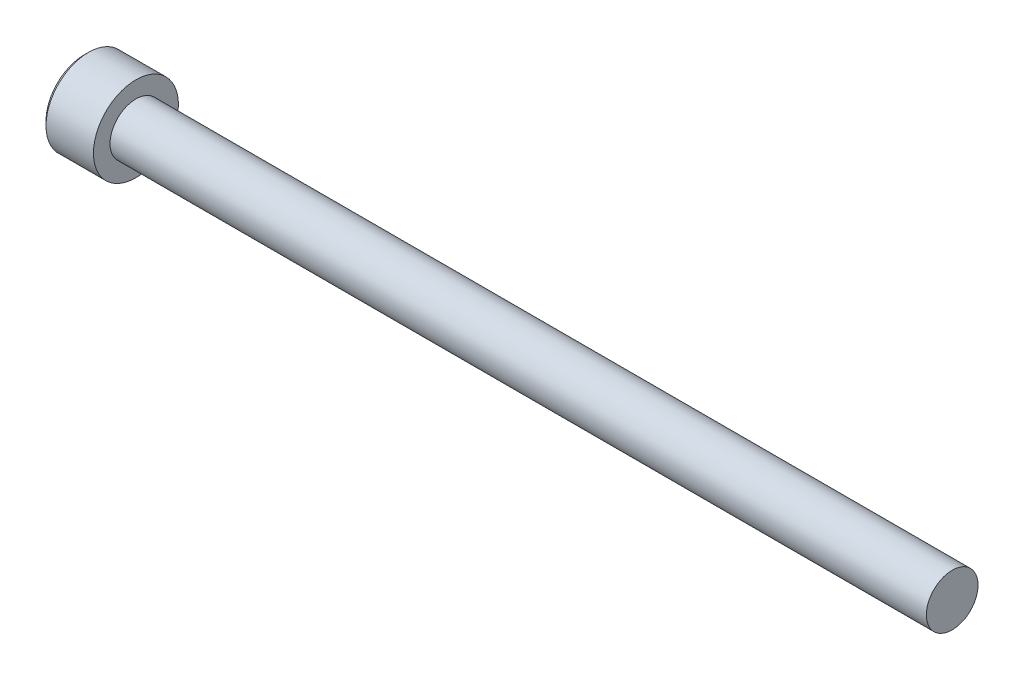
ISO-10303-21;
HEADER;
FILE_DESCRIPTION(('STEP AP214'),'2;1');
FILE_NAME('part.step','',(''),(''),'','','');
FILE_SCHEMA(('AUTOMOTIVE_DESIGN { 1 0 10303 214 1 1 1 1 }'));
ENDSEC;
DATA;
#1=APPLICATION_CONTEXT('core data for automotive mechanical design processes');
#2=APPLICATION_PROTOCOL_DEFINITION('international standard','automotive_design',2000,#1);
#3=PRODUCT_CONTEXT('',#1,'mechanical');
#4=PRODUCT('Part','Part','',(#3));
#5=PRODUCT_RELATED_PRODUCT_CATEGORY('part','',(#4));
#6=PRODUCT_DEFINITION_FORMATION('','',#4);
#7=PRODUCT_DEFINITION_CONTEXT('part definition',#1,'design');
#8=PRODUCT_DEFINITION('design','',#6,#7);
#9=PRODUCT_DEFINITION_SHAPE('','',#8);
#10=(LENGTH_UNIT() NAMED_UNIT(*) SI_UNIT(.MILLI.,.METRE.));
#11=(NAMED_UNIT(*) PLANE_ANGLE_UNIT() SI_UNIT($,.RADIAN.));
#12=(NAMED_UNIT(*) SI_UNIT($,.STERADIAN.) SOLID_ANGLE_UNIT());
#13=UNCERTAINTY_MEASURE_WITH_UNIT(LENGTH_MEASURE(1.E-05),#10,'distance_accuracy_value','');
#14=(GEOMETRIC_REPRESENTATION_CONTEXT(3) GLOBAL_UNCERTAINTY_ASSIGNED_CONTEXT((#13)) GLOBAL_UNIT_ASSIGNED_CONTEXT((#10,
#11,#12)) REPRESENTATION_CONTEXT('',''));
#15=CARTESIAN_POINT('',(0.,0.,0.));
#16=DIRECTION('',(0.,0.,1.));
#17=DIRECTION('',(1.,0.,0.));
#18=AXIS2_PLACEMENT_3D('',#15,#16,#17);
#19=CARTESIAN_POINT('',(-2.28600000000007,-1.14567944042317,1.984375));
#20=DIRECTION('',(0.,0.,1.));
#21=DIRECTION('',(1.,0.,0.));
#22=AXIS2_PLACEMENT_3D('',#19,#20,#21);
#23=PLANE('',#22);
#24=CARTESIAN_POINT('',(-4.82599999995852,1.14567944044653,1.98437499999554));
#25=CARTESIAN_POINT('',(-4.78691618362732,1.06743880343266,1.9843749999984));
#26=CARTESIAN_POINT('',(-4.75011447684892,0.987898318960917,1.98437499999957));
#27=CARTESIAN_POINT('',(-4.68265620500518,0.825677042028778,1.98437500000043));
#28=CARTESIAN_POINT('',(-4.65204056061138,0.742979382529199,1.98437500000012));
#29=CARTESIAN_POINT('',(-4.5991739228306,0.575193959555969,1.98437499999988));
#30=CARTESIAN_POINT('',(-4.57689462080725,0.490115359117279,1.98437499999997));
#31=CARTESIAN_POINT('',(-4.54259467221837,0.318093091130193,1.98437500000003));
#32=CARTESIAN_POINT('',(-4.5305423022885,0.231156054976726,1.984375));
#33=CARTESIAN_POINT('',(-4.52249110263747,0.119918521511051,1.984375));
#34=CARTESIAN_POINT('',(-4.52118947557477,0.0959468443046798,1.984375));
#35=CARTESIAN_POINT('',(-4.51945182629813,0.0479845644411998,1.984375));
#36=CARTESIAN_POINT('',(-4.51901533386223,0.0239939791589393,1.984375));
#37=CARTESIAN_POINT('',(-4.51901809008399,-0.0602201717457363,1.984375));
#38=CARTESIAN_POINT('',(-4.52177452299902,-0.120461721905447,1.984375));
#39=CARTESIAN_POINT('',(-4.5326365512493,-0.240474970989197,1.984375));
#40=CARTESIAN_POINT('',(-4.54074587749718,-0.300246312758427,1.984375));
#41=CARTESIAN_POINT('',(-4.57259622946939,-0.478763752804282,1.984375));
#42=CARTESIAN_POINT('',(-4.60385422611702,-0.596208828937734,1.984375));
#43=CARTESIAN_POINT('',(-4.66780003592237,-0.785921487441256,1.984375));
#44=CARTESIAN_POINT('',(-4.69623457768558,-0.859734609866899,1.984375));
#45=CARTESIAN_POINT('',(-4.75786140400812,-1.00456595519282,1.984375));
#46=CARTESIAN_POINT('',(-4.79100779300359,-1.07560356657101,1.984375));
#47=CARTESIAN_POINT('',(-4.82599999995643,-1.14567944044724,1.984375));
#48=B_SPLINE_CURVE_WITH_KNOTS('',3,(#24,#25,#26,#27,#28,#29,#30,#31,#32,#33,#34,#35,#36,#37,#38,
#39,#40,#41,#42,#43,#44,#45,#46,#47),.UNSPECIFIED.,.F.,.F.,(4,2,2,2,2,2,2,2,2,2,2,4),(0.,
0.262559005207405,0.526801735838036,0.790138824405318,1.05265603861765,1.12466619182083,
1.19663719499031,1.3772702672652,1.55802937209382,1.92104085090328,2.15819130092264,
2.39317265078575),.UNSPECIFIED.);
#49=CARTESIAN_POINT('',(-4.82599999996829,1.14567944041753,1.98437500003084));
#50=VERTEX_POINT('',#49);
#51=CARTESIAN_POINT('',(-4.8259999999622,-1.14567944043207,1.98437500001542));
#52=VERTEX_POINT('',#51);
#53=EDGE_CURVE('E20',#50,#52,#48,.T.);
#54=ORIENTED_EDGE('',*,*,#53,.F.);
#55=DIRECTION('',(1.,0.,0.));
#56=VECTOR('',#55,1.);
#57=CARTESIAN_POINT('',(-2.28600000000007,1.14567944042316,1.984375));
#58=LINE('',#57,#56);
#59=CARTESIAN_POINT('',(-2.28600000000007,1.14567944042316,1.984375));
#60=VERTEX_POINT('',#59);
#61=EDGE_CURVE('E68',#50,#60,#58,.T.);
#62=ORIENTED_EDGE('',*,*,#61,.T.);
#63=DIRECTION('',(0.,1.,0.));
#64=VECTOR('',#63,1.);
#65=CARTESIAN_POINT('',(-2.28600000000007,0.,1.984375));
#66=LINE('',#65,#64);
#67=CARTESIAN_POINT('',(-2.28600000000007,-1.14567944042317,1.984375));
#68=VERTEX_POINT('',#67);
#69=EDGE_CURVE('E74',#68,#60,#66,.T.);
#70=ORIENTED_EDGE('',*,*,#69,.F.);
#71=DIRECTION('',(1.,0.,0.));
#72=VECTOR('',#71,1.);
#73=CARTESIAN_POINT('',(-2.28600000000007,-1.14567944042317,1.984375));
#74=LINE('',#73,#72);
#75=EDGE_CURVE('E71',#68,#52,#74,.F.);
#76=ORIENTED_EDGE('',*,*,#75,.T.);
#77=EDGE_LOOP('',(#54,#62,#70,#76));
#78=FACE_BOUND('',#77,.T.);
#79=ADVANCED_FACE('F16',(#78),#23,.F.);
#80=CARTESIAN_POINT('',(-2.28600000000007,0.,0.));
#81=DIRECTION('',(-1.,0.,0.));
#82=DIRECTION('',(0.,0.,1.));
#83=AXIS2_PLACEMENT_3D('',#80,#81,#82);
#84=PLANE('',#83);
#85=DIRECTION('',(0.,0.5,0.866025403784439));
#86=VECTOR('',#85,1.);
#87=CARTESIAN_POINT('',(-2.28600000000007,2.29135888084633,0.));
#88=LINE('',#87,#86);
#89=CARTESIAN_POINT('',(-2.28600000000007,2.29135888084633,0.));
#90=VERTEX_POINT('',#89);
#91=CARTESIAN_POINT('',(-2.28600000000007,1.14567944042316,-1.984375));
#92=VERTEX_POINT('',#91);
#93=EDGE_CURVE('E82',#90,#92,#88,.F.);
#94=ORIENTED_EDGE('',*,*,#93,.T.);
#95=DIRECTION('',(0.,1.,0.));
#96=VECTOR('',#95,1.);
#97=CARTESIAN_POINT('',(-2.28600000000007,1.14567944042316,-1.984375));
#98=LINE('',#97,#96);
#99=CARTESIAN_POINT('',(-2.28600000000007,-1.14567944042316,-1.984375));
#100=VERTEX_POINT('',#99);
#101=EDGE_CURVE('E242',#92,#100,#98,.F.);
#102=ORIENTED_EDGE('',*,*,#101,.T.);
#103=DIRECTION('',(0.,0.5,-0.866025403784439));
#104=VECTOR('',#103,1.);
#105=CARTESIAN_POINT('',(-2.28600000000007,-1.14567944042316,-1.984375));
#106=LINE('',#105,#104);
#107=CARTESIAN_POINT('',(-2.28600000000007,-2.29135888084633,0.));
#108=VERTEX_POINT('',#107);
#109=EDGE_CURVE('E227',#100,#108,#106,.F.);
#110=ORIENTED_EDGE('',*,*,#109,.T.);
#111=DIRECTION('',(0.,-0.5,-0.866025403784439));
#112=VECTOR('',#111,1.);
#113=CARTESIAN_POINT('',(-2.28600000000007,-2.29135888084633,0.));
#114=LINE('',#113,#112);
#115=EDGE_CURVE('E224',#108,#68,#114,.F.);
#116=ORIENTED_EDGE('',*,*,#115,.T.);
#117=ORIENTED_EDGE('',*,*,#69,.T.);
#118=DIRECTION('',(0.,-0.5,0.866025403784439));
#119=VECTOR('',#118,1.);
#120=CARTESIAN_POINT('',(-2.28600000000007,1.14567944042316,1.984375));
#121=LINE('',#120,#119);
#122=EDGE_CURVE('E81',#60,#90,#121,.F.);
#123=ORIENTED_EDGE('',*,*,#122,.T.);
#124=EDGE_LOOP('',(#94,#102,#110,#116,#117,#123));
#125=FACE_BOUND('',#124,.T.);
#126=ADVANCED_FACE('F160',(#125),#84,.T.);
#127=CARTESIAN_POINT('',(-2.28600000000007,-1.14567944042316,-1.984375));
#128=DIRECTION('',(0.,-0.866025403784439,-0.5));
#129=DIRECTION('',(0.,0.5,-0.866025403784439));
#130=AXIS2_PLACEMENT_3D('',#127,#128,#129);
#131=PLANE('',#130);
#132=CARTESIAN_POINT('',(-4.82599999995871,-1.14567944040756,-1.98437500001887));
#133=CARTESIAN_POINT('',(-4.78666022792997,-1.18505700230148,-1.91617106214563));
#134=CARTESIAN_POINT('',(-4.74963132844072,-1.22509295783734,-1.8468267530301));
#135=CARTESIAN_POINT('',(-4.68183299424977,-1.30673037975396,-1.70542659047317));
#136=CARTESIAN_POINT('',(-4.65110127019237,-1.34833960561553,-1.63335729721673));
#137=CARTESIAN_POINT('',(-4.59845762010516,-1.432242568594,-1.48803310243203));
#138=CARTESIAN_POINT('',(-4.57641341195893,-1.47451494967301,-1.41481519064643));
#139=CARTESIAN_POINT('',(-4.54245011067441,-1.55999007976842,-1.26676792253773));
#140=CARTESIAN_POINT('',(-4.53050567471972,-1.6031902195197,-1.19194308559438));
#141=CARTESIAN_POINT('',(-4.51972842752365,-1.67764765054852,-1.06297903205139));
#142=CARTESIAN_POINT('',(-4.51813352794834,-1.70880881707173,-1.00900630841009));
#143=CARTESIAN_POINT('',(-4.52082392138599,-1.77108016542046,-0.901149169214274));
#144=CARTESIAN_POINT('',(-4.52511127545884,-1.80219032554946,-0.847264791239237));
#145=CARTESIAN_POINT('',(-4.53932219421538,-1.86411684097343,-0.740004920189235));
#146=CARTESIAN_POINT('',(-4.54925206045723,-1.8949328285454,-0.686630064029166));
#147=CARTESIAN_POINT('',(-4.5742029484467,-1.95603190279815,-0.580803363127978));
#148=CARTESIAN_POINT('',(-4.58922357974385,-1.98631503016081,-0.528351447923769));
#149=CARTESIAN_POINT('',(-4.63380478900425,-2.06386502548479,-0.394030915895904));
#150=CARTESIAN_POINT('',(-4.66672213384104,-2.11065153226583,-0.312994309042484));
#151=CARTESIAN_POINT('',(-4.72228952038986,-2.17944749410732,-0.193836207777459));
#152=CARTESIAN_POINT('',(-4.74181309375939,-2.20211890802843,-0.154568166986659));
#153=CARTESIAN_POINT('',(-4.78263970065987,-2.24704195201531,-0.0767591723707469));
#154=CARTESIAN_POINT('',(-4.80394164363173,-2.2692938292399,-0.0382177904539708));
#155=CARTESIAN_POINT('',(-4.82599999995675,-2.29135888085868,2.13931096265935E-11));
#156=B_SPLINE_CURVE_WITH_KNOTS('',3,(#132,#133,#134,#135,#136,#137,#138,#139,#140,#141,#142,
#143,#144,#145,#146,#147,#148,#149,#150,#151,#152,#153,#154,#155),.UNSPECIFIED.,.F.,.F.,(4,2,2,
2,2,2,2,2,2,2,2,4),(0.,0.264284909626495,0.530108996358094,0.791712695414128,1.05265800174404,
1.23942150116703,1.42625045663858,1.61328847394198,1.80031214908683,2.09727151182814,
2.24534838946042,2.39333511890876),.UNSPECIFIED.);
#157=CARTESIAN_POINT('',(-4.8259999999622,-1.14567944043207,-1.98437500001542));
#158=VERTEX_POINT('',#157);
#159=CARTESIAN_POINT('',(-4.82599999996846,-2.2913588808704,-2.00043543490866E-11));
#160=VERTEX_POINT('',#159);
#161=EDGE_CURVE('E162',#158,#160,#156,.T.);
#162=ORIENTED_EDGE('',*,*,#161,.T.);
#163=DIRECTION('',(1.,0.,0.));
#164=VECTOR('',#163,1.);
#165=CARTESIAN_POINT('',(-2.28600000000007,-2.29135888084633,0.));
#166=LINE('',#165,#164);
#167=EDGE_CURVE('E235',#160,#108,#166,.T.);
#168=ORIENTED_EDGE('',*,*,#167,.T.);
#169=ORIENTED_EDGE('',*,*,#109,.F.);
#170=DIRECTION('',(-1.,0.,0.));
#171=VECTOR('',#170,1.);
#172=CARTESIAN_POINT('',(-2.28600000000007,-1.14567944042316,-1.984375));
#173=LINE('',#172,#171);
#174=EDGE_CURVE('E245',#100,#158,#173,.T.);
#175=ORIENTED_EDGE('',*,*,#174,.T.);
#176=EDGE_LOOP('',(#162,#168,#169,#175));
#177=FACE_BOUND('',#176,.T.);
#178=ADVANCED_FACE('F156',(#177),#131,.F.);
#179=CARTESIAN_POINT('',(-2.28600000000007,-2.29135888084633,0.));
#180=DIRECTION('',(0.,-0.866025403784439,0.5));
#181=DIRECTION('',(0.,-0.5,-0.866025403784439));
#182=AXIS2_PLACEMENT_3D('',#179,#180,#181);
#183=PLANE('',#182);
#184=CARTESIAN_POINT('',(-4.8259999999587,-2.29135888085486,-2.29477011545215E-11));
#185=CARTESIAN_POINT('',(-4.78666022792997,-2.25198131896546,0.0682039378529047));
#186=CARTESIAN_POINT('',(-4.74963132844072,-2.21194536343147,0.137548246969502));
#187=CARTESIAN_POINT('',(-4.68183299424977,-2.13030794151622,0.278948409527228));
#188=CARTESIAN_POINT('',(-4.65110127019237,-2.08869871565414,0.351017702783377));
#189=CARTESIAN_POINT('',(-4.59845762010516,-2.00479575267531,0.496341897567867));
#190=CARTESIAN_POINT('',(-4.57641341195893,-1.96252337159644,0.569559809353539));
#191=CARTESIAN_POINT('',(-4.5424501106744,-1.87704824150112,0.717607077462299));
#192=CARTESIAN_POINT('',(-4.53050567471972,-1.8338481017498,0.792431914405622));
#193=CARTESIAN_POINT('',(-4.51972842752365,-1.75939067072096,0.921395967948603));
#194=CARTESIAN_POINT('',(-4.51813352794834,-1.72822950419776,0.975368691589913));
#195=CARTESIAN_POINT('',(-4.52082392138599,-1.66595815584903,1.08322583078573));
#196=CARTESIAN_POINT('',(-4.52511127545884,-1.63484799572003,1.13711020876076));
#197=CARTESIAN_POINT('',(-4.53932219421538,-1.57292148029607,1.24437007981077));
#198=CARTESIAN_POINT('',(-4.54925206045723,-1.54210549272409,1.29774493597084));
#199=CARTESIAN_POINT('',(-4.5742029484467,-1.48100641847134,1.40357163687202));
#200=CARTESIAN_POINT('',(-4.58922357974385,-1.45072329110868,1.45602355207623));
#201=CARTESIAN_POINT('',(-4.63380478900421,-1.37317329578476,1.59034408410398));
#202=CARTESIAN_POINT('',(-4.66672213384095,-1.32638678900379,1.6713806909573));
#203=CARTESIAN_POINT('',(-4.72228952038968,-1.25759082716239,1.79053879222216));
#204=CARTESIAN_POINT('',(-4.74181309375917,-1.23491941324131,1.82980683301291));
#205=CARTESIAN_POINT('',(-4.78263970065959,-1.18999636925449,1.90761582762873));
#206=CARTESIAN_POINT('',(-4.8039416436314,-1.16774449202993,1.94615720954545));
#207=CARTESIAN_POINT('',(-4.82599999995639,-1.14567944041117,1.98437500002077));
#208=B_SPLINE_CURVE_WITH_KNOTS('',3,(#184,#185,#186,#187,#188,#189,#190,#191,#192,#193,#194,
#195,#196,#197,#198,#199,#200,#201,#202,#203,#204,#205,#206,#207),.UNSPECIFIED.,.F.,.F.,(4,2,2,
2,2,2,2,2,2,2,2,4),(0.,0.264284909626493,0.530108996358089,0.791712695414125,1.05265800174404,
1.23942150116703,1.42625045663858,1.61328847394198,1.80031214908683,2.09727151182773,
2.24534838945981,2.39333511890795),.UNSPECIFIED.);
#209=EDGE_CURVE('E91',#160,#52,#208,.T.);
#210=ORIENTED_EDGE('',*,*,#209,.T.);
#211=ORIENTED_EDGE('',*,*,#75,.F.);
#212=ORIENTED_EDGE('',*,*,#115,.F.);
#213=ORIENTED_EDGE('',*,*,#167,.F.);
#214=EDGE_LOOP('',(#210,#211,#212,#213));
#215=FACE_BOUND('',#214,.T.);
#216=ADVANCED_FACE('F151',(#215),#183,.F.);
#217=CARTESIAN_POINT('',(-2.28600000000007,1.14567944042316,1.984375));
#218=DIRECTION('',(0.,0.866025403784439,0.5));
#219=DIRECTION('',(0.,-0.5,0.866025403784439));
#220=AXIS2_PLACEMENT_3D('',#217,#218,#219);
#221=PLANE('',#220);
#222=CARTESIAN_POINT('',(-4.82599999995852,1.14567944040762,1.98437500001801));
#223=CARTESIAN_POINT('',(-4.78666022792973,1.1850570023017,1.91617106214498));
#224=CARTESIAN_POINT('',(-4.74963132844047,1.22509295783761,1.84682675302957));
#225=CARTESIAN_POINT('',(-4.68183299424957,1.30673037975422,1.70542659047278));
#226=CARTESIAN_POINT('',(-4.65110127019222,1.34833960561574,1.63335729721638));
#227=CARTESIAN_POINT('',(-4.59845762010509,1.43224256859413,1.48803310243178));
#228=CARTESIAN_POINT('',(-4.57641341195888,1.47451494967311,1.41481519064625));
#229=CARTESIAN_POINT('',(-4.54245011067439,1.55999007976846,1.26676792253767));
#230=CARTESIAN_POINT('',(-4.53050567471972,1.6031902195197,1.19194308559439));
#231=CARTESIAN_POINT('',(-4.51972842752365,1.67764765054848,1.06297903205146));
#232=CARTESIAN_POINT('',(-4.51813352794835,1.70880881707169,1.00900630841016));
#233=CARTESIAN_POINT('',(-4.52082392138598,1.77108016542041,0.901149169214364));
#234=CARTESIAN_POINT('',(-4.52511127545883,1.80219032554941,0.847264791239333));
#235=CARTESIAN_POINT('',(-4.53932219421536,1.86411684097336,0.740004920189342));
#236=CARTESIAN_POINT('',(-4.54925206045721,1.89493282854533,0.686630064029278));
#237=CARTESIAN_POINT('',(-4.57420294844667,1.95603190279808,0.5808033631281));
#238=CARTESIAN_POINT('',(-4.58922357974382,1.98631503016074,0.528351447923897));
#239=CARTESIAN_POINT('',(-4.6338047890042,2.06386502548473,0.394030915896012));
#240=CARTESIAN_POINT('',(-4.666722133841,2.11065153226578,0.312994309042568));
#241=CARTESIAN_POINT('',(-4.72228952038984,2.17944749410729,0.19383620777751));
#242=CARTESIAN_POINT('',(-4.74181309375937,2.20211890802841,0.1545681669867));
#243=CARTESIAN_POINT('',(-4.78263970065986,2.24704195201529,0.0767591723707674));
#244=CARTESIAN_POINT('',(-4.80394164363172,2.26929382923989,0.0382177904539813));
#245=CARTESIAN_POINT('',(-4.82599999995675,2.29135888085868,-2.1392886942985E-11));
#246=B_SPLINE_CURVE_WITH_KNOTS('',3,(#222,#223,#224,#225,#226,#227,#228,#229,#230,#231,#232,
#233,#234,#235,#236,#237,#238,#239,#240,#241,#242,#243,#244,#245),.UNSPECIFIED.,.F.,.F.,(4,2,2,
2,2,2,2,2,2,2,2,4),(0.,0.26428490962629,0.530108996357672,0.791712695413487,1.05265800174319,
1.23942150116616,1.42625045663768,1.61328847394106,1.80031214908589,2.09727151182728,
2.2453483894596,2.39333511890798),.UNSPECIFIED.);
#247=CARTESIAN_POINT('',(-4.82599999996846,2.29135888087039,2.00042061038936E-11));
#248=VERTEX_POINT('',#247);
#249=EDGE_CURVE('E79',#50,#248,#246,.T.);
#250=ORIENTED_EDGE('',*,*,#249,.T.);
#251=DIRECTION('',(1.,0.,0.));
#252=VECTOR('',#251,1.);
#253=CARTESIAN_POINT('',(-2.28600000000007,2.29135888084633,0.));
#254=LINE('',#253,#252);
#255=EDGE_CURVE('E246',#248,#90,#254,.T.);
#256=ORIENTED_EDGE('',*,*,#255,.T.);
#257=ORIENTED_EDGE('',*,*,#122,.F.);
#258=ORIENTED_EDGE('',*,*,#61,.F.);
#259=EDGE_LOOP('',(#250,#256,#257,#258));
#260=FACE_BOUND('',#259,.T.);
#261=ADVANCED_FACE('F76',(#260),#221,.F.);
#262=CARTESIAN_POINT('',(-2.28600000000007,2.29135888084633,0.));
#263=DIRECTION('',(0.,0.866025403784439,-0.5));
#264=DIRECTION('',(0.,0.5,0.866025403784439));
#265=AXIS2_PLACEMENT_3D('',#262,#263,#264);
#266=PLANE('',#265);
#267=CARTESIAN_POINT('',(-4.82599999995871,2.29135888085486,2.29489280696874E-11));
#268=CARTESIAN_POINT('',(-4.78666022792997,2.25198131896547,-0.0682039378529039));
#269=CARTESIAN_POINT('',(-4.74963132844072,2.21194536343147,-0.137548246969502));
#270=CARTESIAN_POINT('',(-4.68183299424977,2.13030794151622,-0.278948409527229));
#271=CARTESIAN_POINT('',(-4.65110127019237,2.08869871565414,-0.351017702783379));
#272=CARTESIAN_POINT('',(-4.59845762010516,2.00479575267531,-0.496341897567869));
#273=CARTESIAN_POINT('',(-4.57641341195893,1.96252337159644,-0.569559809353541));
#274=CARTESIAN_POINT('',(-4.5424501106744,1.87704824150112,-0.7176070774623));
#275=CARTESIAN_POINT('',(-4.53050567471972,1.8338481017498,-0.792431914405622));
#276=CARTESIAN_POINT('',(-4.51972842752365,1.75939067072096,-0.921395967948603));
#277=CARTESIAN_POINT('',(-4.51813352794834,1.72822950419776,-0.975368691589912));
#278=CARTESIAN_POINT('',(-4.52082392138599,1.66595815584903,-1.08322583078573));
#279=CARTESIAN_POINT('',(-4.52511127545884,1.63484799572003,-1.13711020876076));
#280=CARTESIAN_POINT('',(-4.53932219421538,1.57292148029607,-1.24437007981077));
#281=CARTESIAN_POINT('',(-4.54925206045723,1.54210549272409,-1.29774493597083));
#282=CARTESIAN_POINT('',(-4.5742029484467,1.48100641847134,-1.40357163687202));
#283=CARTESIAN_POINT('',(-4.58922357974385,1.45072329110868,-1.45602355207623));
#284=CARTESIAN_POINT('',(-4.63380478900425,1.3731732957847,-1.5903440841041));
#285=CARTESIAN_POINT('',(-4.66672213384104,1.32638678900366,-1.67138069095752));
#286=CARTESIAN_POINT('',(-4.72228952038986,1.25759082716218,-1.79053879222254));
#287=CARTESIAN_POINT('',(-4.74181309375939,1.23491941324106,-1.82980683301334));
#288=CARTESIAN_POINT('',(-4.78263970065987,1.18999636925419,-1.90761582762925));
#289=CARTESIAN_POINT('',(-4.80394164363173,1.1677444920296,-1.94615720954603));
#290=CARTESIAN_POINT('',(-4.82599999995675,1.14567944041081,-1.98437500002139));
#291=B_SPLINE_CURVE_WITH_KNOTS('',3,(#267,#268,#269,#270,#271,#272,#273,#274,#275,#276,#277,
#278,#279,#280,#281,#282,#283,#284,#285,#286,#287,#288,#289,#290),.UNSPECIFIED.,.F.,.F.,(4,2,2,
2,2,2,2,2,2,2,2,4),(0.,0.264284909626495,0.530108996358093,0.791712695414127,1.05265800174404,
1.23942150116703,1.42625045663858,1.61328847394198,1.80031214908683,2.09727151182814,
2.24534838946042,2.39333511890876),.UNSPECIFIED.);
#292=CARTESIAN_POINT('',(-4.82599999996846,1.14567944045252,-1.98437500001084));
#293=VERTEX_POINT('',#292);
#294=EDGE_CURVE('E39',#248,#293,#291,.T.);
#295=ORIENTED_EDGE('',*,*,#294,.T.);
#296=DIRECTION('',(-1.,0.,0.));
#297=VECTOR('',#296,1.);
#298=CARTESIAN_POINT('',(-2.28600000000007,1.14567944042316,-1.984375));
#299=LINE('',#298,#297);
#300=EDGE_CURVE('E166',#293,#92,#299,.F.);
#301=ORIENTED_EDGE('',*,*,#300,.T.);
#302=ORIENTED_EDGE('',*,*,#93,.F.);
#303=ORIENTED_EDGE('',*,*,#255,.F.);
#304=EDGE_LOOP('',(#295,#301,#302,#303));
#305=FACE_BOUND('',#304,.T.);
#306=ADVANCED_FACE('F150',(#305),#266,.F.);
#307=CARTESIAN_POINT('',(-2.28600000000007,1.14567944042316,-1.984375));
#308=DIRECTION('',(0.,0.,-1.));
#309=DIRECTION('',(-1.,0.,0.));
#310=AXIS2_PLACEMENT_3D('',#307,#308,#309);
#311=PLANE('',#310);
#312=CARTESIAN_POINT('',(-4.8259999999587,1.14567944044731,-1.98437499999592));
#313=CARTESIAN_POINT('',(-4.78666022793094,1.06692431665146,-1.98437499999853));
#314=CARTESIAN_POINT('',(-4.74963132844318,0.986852405569011,-1.98437499999961));
#315=CARTESIAN_POINT('',(-4.6818329942566,0.823577561711963,-1.9843750000004));
#316=CARTESIAN_POINT('',(-4.65110127020207,0.740359109975722,-1.98437500000011));
#317=CARTESIAN_POINT('',(-4.59845762012233,0.572553183993917,-1.9843749999999));
#318=CARTESIAN_POINT('',(-4.57641341198063,0.488008421824127,-1.98437499999997));
#319=CARTESIAN_POINT('',(-4.54245011070673,0.317058161610178,-1.98437500000003));
#320=CARTESIAN_POINT('',(-4.53050567475816,0.230657882096267,-1.98437500000001));
#321=CARTESIAN_POINT('',(-4.51972842757294,0.0817430200124032,-1.984375));
#322=CARTESIAN_POINT('',(-4.51813352800283,0.0194206869508218,-1.984375));
#323=CARTESIAN_POINT('',(-4.52082392145254,-0.1051220097764,-1.984375));
#324=CARTESIAN_POINT('',(-4.52511127553227,-0.167342330049008,-1.984375));
#325=CARTESIAN_POINT('',(-4.53932219430377,-0.291195360925477,-1.984375));
#326=CARTESIAN_POINT('',(-4.54925206055372,-0.352827336083362,-1.984375));
#327=CARTESIAN_POINT('',(-4.57420294856008,-0.475025484616114,-1.984375));
#328=CARTESIAN_POINT('',(-4.58922357986604,-0.535591739354747,-1.984375));
#329=CARTESIAN_POINT('',(-4.63380478912724,-0.690691729958653,-1.984375));
#330=CARTESIAN_POINT('',(-4.66672213394715,-0.784264743465576,-1.984375));
#331=CARTESIAN_POINT('',(-4.7222895204619,-0.921856667069616,-1.984375));
#332=CARTESIAN_POINT('',(-4.74181309381856,-0.967199494886089,-1.984375));
#333=CARTESIAN_POINT('',(-4.78263970069104,-1.05704558280959,-1.984375));
#334=CARTESIAN_POINT('',(-4.80394164364776,-1.10154933723428,-1.984375));
#335=CARTESIAN_POINT('',(-4.82599999995675,-1.14567944044787,-1.984375));
#336=B_SPLINE_CURVE_WITH_KNOTS('',3,(#312,#313,#314,#315,#316,#317,#318,#319,#320,#321,#322,
#323,#324,#325,#326,#327,#328,#329,#330,#331,#332,#333,#334,#335),.UNSPECIFIED.,.F.,.F.,(4,2,2,
2,2,2,2,2,2,2,2,4),(0.,0.264284909658836,0.530108996422784,0.791712695509868,1.0526580018708,
1.23942150133878,1.42625045685537,1.61328847420389,1.80031214939384,2.09727151196384,
2.24534838950992,2.39333511887245),.UNSPECIFIED.);
#337=EDGE_CURVE('E108',#293,#158,#336,.T.);
#338=ORIENTED_EDGE('',*,*,#337,.T.);
#339=ORIENTED_EDGE('',*,*,#174,.F.);
#340=ORIENTED_EDGE('',*,*,#101,.F.);
#341=ORIENTED_EDGE('',*,*,#300,.F.);
#342=EDGE_LOOP('',(#338,#339,#340,#341));
#343=FACE_BOUND('',#342,.T.);
#344=ADVANCED_FACE('F121',(#343),#311,.F.);
#345=CARTESIAN_POINT('',(-4.82599999998001,0.,0.));
#346=DIRECTION('',(-1.,0.,0.));
#347=DIRECTION('',(0.,0.,1.));
#348=AXIS2_PLACEMENT_3D('',#345,#346,#347);
#349=CONICAL_SURFACE('',#348,2.29135888088194,0.785398163397448);
#350=ORIENTED_EDGE('',*,*,#161,.F.);
#351=CARTESIAN_POINT('',(-4.82599999998001,0.,0.));
#352=DIRECTION('',(-1.,0.,0.));
#353=DIRECTION('',(0.,0.,1.));
#354=AXIS2_PLACEMENT_3D('',#351,#352,#353);
#355=CIRCLE('',#354,2.29135888088194);
#356=EDGE_CURVE('E105',#158,#160,#355,.T.);
#357=ORIENTED_EDGE('',*,*,#356,.T.);
#358=EDGE_LOOP('',(#350,#357));
#359=FACE_BOUND('',#358,.T.);
#360=ADVANCED_FACE('F167',(#359),#349,.F.);
#361=CARTESIAN_POINT('',(-4.82599999998001,0.,0.));
#362=DIRECTION('',(-1.,0.,0.));
#363=DIRECTION('',(0.,0.,1.));
#364=AXIS2_PLACEMENT_3D('',#361,#362,#363);
#365=CONICAL_SURFACE('',#364,2.29135888088194,0.785398163397448);
#366=ORIENTED_EDGE('',*,*,#209,.F.);
#367=CARTESIAN_POINT('',(-4.82599999998001,0.,0.));
#368=DIRECTION('',(-1.,0.,0.));
#369=DIRECTION('',(0.,0.,1.));
#370=AXIS2_PLACEMENT_3D('',#367,#368,#369);
#371=CIRCLE('',#370,2.29135888088194);
#372=EDGE_CURVE('E86',#160,#52,#371,.T.);
#373=ORIENTED_EDGE('',*,*,#372,.T.);
#374=EDGE_LOOP('',(#366,#373));
#375=FACE_BOUND('',#374,.T.);
#376=ADVANCED_FACE('F170',(#375),#365,.F.);
#377=CARTESIAN_POINT('',(-4.82599999998001,0.,0.));
#378=DIRECTION('',(-1.,0.,0.));
#379=DIRECTION('',(0.,0.,1.));
#380=AXIS2_PLACEMENT_3D('',#377,#378,#379);
#381=CONICAL_SURFACE('',#380,2.29135888088194,0.78539816348948);
#382=CARTESIAN_POINT('',(-4.82599999998001,0.,0.));
#383=DIRECTION('',(-1.,0.,0.));
#384=DIRECTION('',(0.,0.,1.));
#385=AXIS2_PLACEMENT_3D('',#382,#383,#384);
#386=CIRCLE('',#385,2.29135888088194);
#387=EDGE_CURVE('E59',#52,#50,#386,.T.);
#388=ORIENTED_EDGE('',*,*,#387,.T.);
#389=ORIENTED_EDGE('',*,*,#53,.T.);
#390=EDGE_LOOP('',(#388,#389));
#391=FACE_BOUND('',#390,.T.);
#392=ADVANCED_FACE('F84',(#391),#381,.F.);
#393=CARTESIAN_POINT('',(-4.82599999998001,0.,0.));
#394=DIRECTION('',(-1.,0.,0.));
#395=DIRECTION('',(0.,0.,1.));
#396=AXIS2_PLACEMENT_3D('',#393,#394,#395);
#397=CONICAL_SURFACE('',#396,2.29135888088194,0.785398163397448);
#398=ORIENTED_EDGE('',*,*,#249,.F.);
#399=CARTESIAN_POINT('',(-4.82599999998001,0.,0.));
#400=DIRECTION('',(-1.,0.,0.));
#401=DIRECTION('',(0.,0.,1.));
#402=AXIS2_PLACEMENT_3D('',#399,#400,#401);
#403=CIRCLE('',#402,2.29135888088194);
#404=EDGE_CURVE('E85',#50,#248,#403,.T.);
#405=ORIENTED_EDGE('',*,*,#404,.T.);
#406=EDGE_LOOP('',(#398,#405));
#407=FACE_BOUND('',#406,.T.);
#408=ADVANCED_FACE('F90',(#407),#397,.F.);
#409=CARTESIAN_POINT('',(-4.82599999998001,0.,0.));
#410=DIRECTION('',(-1.,0.,0.));
#411=DIRECTION('',(0.,0.,1.));
#412=AXIS2_PLACEMENT_3D('',#409,#410,#411);
#413=CONICAL_SURFACE('',#412,2.29135888088194,0.785398163397448);
#414=ORIENTED_EDGE('',*,*,#294,.F.);
#415=CARTESIAN_POINT('',(-4.82599999998001,0.,0.));
#416=DIRECTION('',(-1.,0.,0.));
#417=DIRECTION('',(0.,0.,1.));
#418=AXIS2_PLACEMENT_3D('',#415,#416,#417);
#419=CIRCLE('',#418,2.29135888088194);
#420=EDGE_CURVE('E97',#248,#293,#419,.T.);
#421=ORIENTED_EDGE('',*,*,#420,.T.);
#422=EDGE_LOOP('',(#414,#421));
#423=FACE_BOUND('',#422,.T.);
#424=ADVANCED_FACE('F128',(#423),#413,.F.);
#425=CARTESIAN_POINT('',(-4.82599999998001,0.,0.));
#426=DIRECTION('',(-1.,0.,0.));
#427=DIRECTION('',(0.,0.,1.));
#428=AXIS2_PLACEMENT_3D('',#425,#426,#427);
#429=CONICAL_SURFACE('',#428,2.29135888088194,0.785398163489476);
#430=ORIENTED_EDGE('',*,*,#337,.F.);
#431=CARTESIAN_POINT('',(-4.82599999998001,0.,0.));
#432=DIRECTION('',(-1.,0.,0.));
#433=DIRECTION('',(0.,0.,1.));
#434=AXIS2_PLACEMENT_3D('',#431,#432,#433);
#435=CIRCLE('',#434,2.29135888088194);
#436=EDGE_CURVE('E99',#293,#158,#435,.T.);
#437=ORIENTED_EDGE('',*,*,#436,.T.);
#438=EDGE_LOOP('',(#430,#437));
#439=FACE_BOUND('',#438,.T.);
#440=ADVANCED_FACE('F124',(#439),#429,.F.);
#441=CARTESIAN_POINT('',(-4.82600000000007,0.,0.));
#442=DIRECTION('',(1.,0.,0.));
#443=DIRECTION('',(0.,0.,-1.));
#444=AXIS2_PLACEMENT_3D('',#441,#442,#443);
#445=PLANE('',#444);
#446=CARTESIAN_POINT('',(-4.82599999998001,0.,0.));
#447=DIRECTION('',(1.,0.,0.));
#448=DIRECTION('',(0.,0.,-1.));
#449=AXIS2_PLACEMENT_3D('',#446,#447,#448);
#450=CIRCLE('',#449,3.56615999999121);
#451=CARTESIAN_POINT('',(-4.82599999998001,0.,-3.56615999999121));
#452=VERTEX_POINT('',#451);
#453=EDGE_CURVE('E212',#452,#452,#450,.T.);
#454=ORIENTED_EDGE('',*,*,#453,.F.);
#455=EDGE_LOOP('',(#454));
#456=FACE_BOUND('',#455,.T.);
#457=ORIENTED_EDGE('',*,*,#420,.F.);
#458=ORIENTED_EDGE('',*,*,#404,.F.);
#459=ORIENTED_EDGE('',*,*,#387,.F.);
#460=ORIENTED_EDGE('',*,*,#372,.F.);
#461=ORIENTED_EDGE('',*,*,#356,.F.);
#462=ORIENTED_EDGE('',*,*,#436,.F.);
#463=EDGE_LOOP('',(#457,#458,#459,#460,#461,#462));
#464=FACE_BOUND('',#463,.T.);
#465=ADVANCED_FACE('F94',(#456,#464),#445,.F.);
#466=CARTESIAN_POINT('',(-4.42976000010731,0.,0.));
#467=DIRECTION('',(1.,0.,0.));
#468=DIRECTION('',(0.,0.,-1.));
#469=AXIS2_PLACEMENT_3D('',#466,#467,#468);
#470=CONICAL_SURFACE('',#469,3.96239999986392,0.785398163397448);
#471=CARTESIAN_POINT('',(-4.42976000000007,0.,0.));
#472=DIRECTION('',(-1.,0.,0.));
#473=DIRECTION('',(0.,0.,1.));
#474=AXIS2_PLACEMENT_3D('',#471,#472,#473);
#475=CIRCLE('',#474,3.9624);
#476=CARTESIAN_POINT('',(-4.42976000000007,0.,3.9624));
#477=VERTEX_POINT('',#476);
#478=EDGE_CURVE('E209',#477,#477,#475,.F.);
#479=ORIENTED_EDGE('',*,*,#478,.F.);
#480=EDGE_LOOP('',(#479));
#481=FACE_BOUND('',#480,.T.);
#482=ORIENTED_EDGE('',*,*,#453,.T.);
#483=EDGE_LOOP('',(#482));
#484=FACE_BOUND('',#483,.T.);
#485=ADVANCED_FACE('F198',(#481,#484),#470,.T.);
#486=CARTESIAN_POINT('',(-4.82600000000008,0.,0.));
#487=DIRECTION('',(-1.,0.,0.));
#488=DIRECTION('',(0.,0.,1.));
#489=AXIS2_PLACEMENT_3D('',#486,#487,#488);
#490=CYLINDRICAL_SURFACE('',#489,3.9624);
#491=ORIENTED_EDGE('',*,*,#478,.T.);
#492=EDGE_LOOP('',(#491));
#493=FACE_BOUND('',#492,.T.);
#494=CARTESIAN_POINT('',(0.,0.,0.));
#495=DIRECTION('',(-1.,0.,0.));
#496=DIRECTION('',(0.,0.,1.));
#497=AXIS2_PLACEMENT_3D('',#494,#495,#496);
#498=CIRCLE('',#497,3.9624);
#499=CARTESIAN_POINT('',(0.,0.,3.9624));
#500=VERTEX_POINT('',#499);
#501=EDGE_CURVE('E214',#500,#500,#498,.T.);
#502=ORIENTED_EDGE('',*,*,#501,.T.);
#503=EDGE_LOOP('',(#502));
#504=FACE_BOUND('',#503,.T.);
#505=ADVANCED_FACE('F195',(#493,#504),#490,.T.);
#506=CARTESIAN_POINT('',(76.2,0.,0.));
#507=DIRECTION('',(1.,0.,0.));
#508=DIRECTION('',(0.,0.,-1.));
#509=AXIS2_PLACEMENT_3D('',#506,#507,#508);
#510=PLANE('',#509);
#511=CARTESIAN_POINT('',(76.2,0.,0.));
#512=DIRECTION('',(-1.,0.,0.));
#513=DIRECTION('',(0.,0.,1.));
#514=AXIS2_PLACEMENT_3D('',#511,#512,#513);
#515=CIRCLE('',#514,2.413);
#516=CARTESIAN_POINT('',(76.2,0.,2.413));
#517=VERTEX_POINT('',#516);
#518=EDGE_CURVE('E30',#517,#517,#515,.T.);
#519=ORIENTED_EDGE('',*,*,#518,.F.);
#520=EDGE_LOOP('',(#519));
#521=FACE_BOUND('',#520,.T.);
#522=ADVANCED_FACE('F188',(#521),#510,.T.);
#523=CARTESIAN_POINT('',(0.,3.9624,0.));
#524=DIRECTION('',(-1.,0.,0.));
#525=DIRECTION('',(0.,0.,1.));
#526=AXIS2_PLACEMENT_3D('',#523,#524,#525);
#527=PLANE('',#526);
#528=CARTESIAN_POINT('',(0.,0.,0.));
#529=DIRECTION('',(-1.,0.,0.));
#530=DIRECTION('',(0.,0.,1.));
#531=AXIS2_PLACEMENT_3D('',#528,#529,#530);
#532=CIRCLE('',#531,2.413);
#533=CARTESIAN_POINT('',(0.,0.,2.413));
#534=VERTEX_POINT('',#533);
#535=EDGE_CURVE('E11',#534,#534,#532,.F.);
#536=ORIENTED_EDGE('',*,*,#535,.F.);
#537=EDGE_LOOP('',(#536));
#538=FACE_BOUND('',#537,.T.);
#539=ORIENTED_EDGE('',*,*,#501,.F.);
#540=EDGE_LOOP('',(#539));
#541=FACE_BOUND('',#540,.T.);
#542=ADVANCED_FACE('F182',(#538,#541),#527,.F.);
#543=CARTESIAN_POINT('',(76.2,0.,0.));
#544=DIRECTION('',(-1.,0.,0.));
#545=DIRECTION('',(0.,0.,1.));
#546=AXIS2_PLACEMENT_3D('',#543,#544,#545);
#547=CYLINDRICAL_SURFACE('',#546,2.413);
#548=ORIENTED_EDGE('',*,*,#535,.T.);
#549=EDGE_LOOP('',(#548));
#550=FACE_BOUND('',#549,.T.);
#551=ORIENTED_EDGE('',*,*,#518,.T.);
#552=EDGE_LOOP('',(#551));
#553=FACE_BOUND('',#552,.T.);
#554=ADVANCED_FACE('F180',(#550,#553),#547,.T.);
#555=CLOSED_SHELL('',(#79,#126,#178,#216,#261,#306,#344,#360,#376,#392,#408,#424,#440,#465,#485,
#505,#522,#542,#554));
#556=MANIFOLD_SOLID_BREP('B1',#555);
#557=ADVANCED_BREP_SHAPE_REPRESENTATION('',(#18,#556),#14);
#558=SHAPE_DEFINITION_REPRESENTATION(#9,#557);
ENDSEC;
END-ISO-10303-21;
